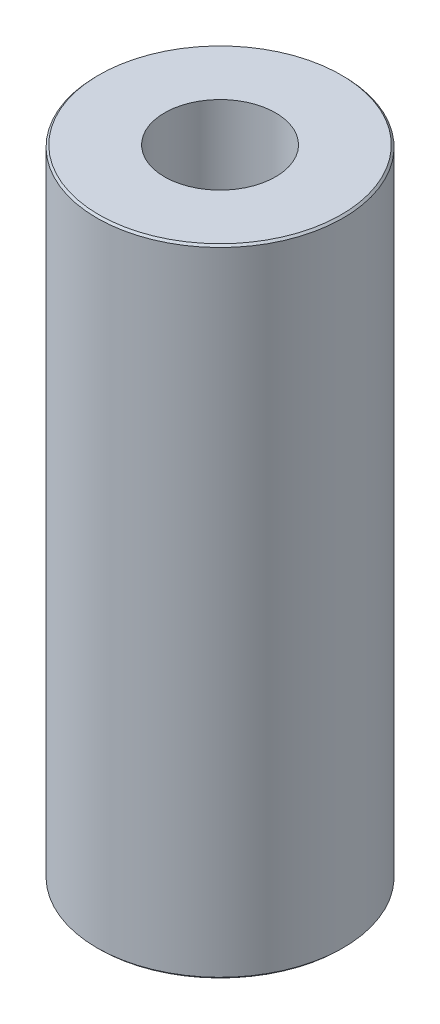
ISO-10303-21;
HEADER;
FILE_DESCRIPTION(('STEP AP214'),'2;1');
FILE_NAME('part.step','',(''),(''),'','','');
FILE_SCHEMA(('AUTOMOTIVE_DESIGN { 1 0 10303 214 1 1 1 1 }'));
ENDSEC;
DATA;
#1=APPLICATION_CONTEXT('core data for automotive mechanical design processes');
#2=APPLICATION_PROTOCOL_DEFINITION('international standard','automotive_design',2000,#1);
#3=PRODUCT_CONTEXT('',#1,'mechanical');
#4=PRODUCT('Part','Part','',(#3));
#5=PRODUCT_RELATED_PRODUCT_CATEGORY('part','',(#4));
#6=PRODUCT_DEFINITION_FORMATION('','',#4);
#7=PRODUCT_DEFINITION_CONTEXT('part definition',#1,'design');
#8=PRODUCT_DEFINITION('design','',#6,#7);
#9=PRODUCT_DEFINITION_SHAPE('','',#8);
#10=(LENGTH_UNIT() NAMED_UNIT(*) SI_UNIT(.MILLI.,.METRE.));
#11=(NAMED_UNIT(*) PLANE_ANGLE_UNIT() SI_UNIT($,.RADIAN.));
#12=(NAMED_UNIT(*) SI_UNIT($,.STERADIAN.) SOLID_ANGLE_UNIT());
#13=UNCERTAINTY_MEASURE_WITH_UNIT(LENGTH_MEASURE(1.E-05),#10,'distance_accuracy_value','');
#14=(GEOMETRIC_REPRESENTATION_CONTEXT(3) GLOBAL_UNCERTAINTY_ASSIGNED_CONTEXT((#13)) GLOBAL_UNIT_ASSIGNED_CONTEXT((#10,
#11,#12)) REPRESENTATION_CONTEXT('',''));
#15=CARTESIAN_POINT('',(0.,0.,0.));
#16=DIRECTION('',(0.,0.,1.));
#17=DIRECTION('',(1.,0.,0.));
#18=AXIS2_PLACEMENT_3D('',#15,#16,#17);
#19=CARTESIAN_POINT('',(0.,180.864894282994,0.));
#20=DIRECTION('',(0.,-1.,0.));
#21=DIRECTION('',(0.,0.,-1.));
#22=AXIS2_PLACEMENT_3D('',#19,#20,#21);
#23=CYLINDRICAL_SURFACE('',#22,35.);
#24=CARTESIAN_POINT('',(0.,180.317398691973,0.));
#25=DIRECTION('',(0.,1.,0.));
#26=DIRECTION('',(0.,0.,1.));
#27=AXIS2_PLACEMENT_3D('',#24,#25,#26);
#28=CIRCLE('',#27,35.);
#29=CARTESIAN_POINT('',(0.,180.317398691973,35.));
#30=VERTEX_POINT('',#29);
#31=EDGE_CURVE('E50',#30,#30,#28,.F.);
#32=ORIENTED_EDGE('',*,*,#31,.T.);
#33=EDGE_LOOP('',(#32));
#34=FACE_BOUND('',#33,.T.);
#35=CARTESIAN_POINT('',(0.,0.547495591021102,0.));
#36=DIRECTION('',(0.,1.,0.));
#37=DIRECTION('',(0.,0.,1.));
#38=AXIS2_PLACEMENT_3D('',#35,#36,#37);
#39=CIRCLE('',#38,35.);
#40=CARTESIAN_POINT('',(0.,0.547495591021102,35.));
#41=VERTEX_POINT('',#40);
#42=EDGE_CURVE('E51',#41,#41,#39,.T.);
#43=ORIENTED_EDGE('',*,*,#42,.T.);
#44=EDGE_LOOP('',(#43));
#45=FACE_BOUND('',#44,.T.);
#46=ADVANCED_FACE('F39',(#34,#45),#23,.T.);
#47=CARTESIAN_POINT('',(0.,180.864894282994,0.));
#48=DIRECTION('',(0.,1.,0.));
#49=DIRECTION('',(0.,0.,1.));
#50=AXIS2_PLACEMENT_3D('',#47,#48,#49);
#51=PLANE('',#50);
#52=CARTESIAN_POINT('',(0.,180.864894282994,0.));
#53=DIRECTION('',(0.,1.,0.));
#54=DIRECTION('',(0.,0.,1.));
#55=AXIS2_PLACEMENT_3D('',#52,#53,#54);
#56=CIRCLE('',#55,34.4525044089789);
#57=CARTESIAN_POINT('',(0.,180.864894282994,34.4525044089789));
#58=VERTEX_POINT('',#57);
#59=EDGE_CURVE('E54',#58,#58,#56,.T.);
#60=ORIENTED_EDGE('',*,*,#59,.T.);
#61=EDGE_LOOP('',(#60));
#62=FACE_BOUND('',#61,.T.);
#63=CARTESIAN_POINT('',(0.,180.864894282994,0.));
#64=DIRECTION('',(0.,1.,0.));
#65=DIRECTION('',(0.,0.,1.));
#66=AXIS2_PLACEMENT_3D('',#63,#64,#65);
#67=CIRCLE('',#66,15.7891906543089);
#68=CARTESIAN_POINT('',(0.,180.864894282994,15.7891906543089));
#69=VERTEX_POINT('',#68);
#70=EDGE_CURVE('E58',#69,#69,#67,.T.);
#71=ORIENTED_EDGE('',*,*,#70,.F.);
#72=EDGE_LOOP('',(#71));
#73=FACE_BOUND('',#72,.T.);
#74=ADVANCED_FACE('F69',(#62,#73),#51,.T.);
#75=CARTESIAN_POINT('',(0.,0.,0.));
#76=DIRECTION('',(0.,1.,0.));
#77=DIRECTION('',(0.,0.,1.));
#78=AXIS2_PLACEMENT_3D('',#75,#76,#77);
#79=PLANE('',#78);
#80=CARTESIAN_POINT('',(0.,0.,0.));
#81=DIRECTION('',(0.,1.,0.));
#82=DIRECTION('',(0.,0.,1.));
#83=AXIS2_PLACEMENT_3D('',#80,#81,#82);
#84=CIRCLE('',#83,34.4525044089789);
#85=CARTESIAN_POINT('',(0.,0.,34.4525044089789));
#86=VERTEX_POINT('',#85);
#87=EDGE_CURVE('E10',#86,#86,#84,.F.);
#88=ORIENTED_EDGE('',*,*,#87,.T.);
#89=EDGE_LOOP('',(#88));
#90=FACE_BOUND('',#89,.T.);
#91=CARTESIAN_POINT('',(0.,0.,0.));
#92=DIRECTION('',(0.,1.,0.));
#93=DIRECTION('',(0.,0.,1.));
#94=AXIS2_PLACEMENT_3D('',#91,#92,#93);
#95=CIRCLE('',#94,15.7891906543089);
#96=CARTESIAN_POINT('',(0.,0.,15.7891906543089));
#97=VERTEX_POINT('',#96);
#98=EDGE_CURVE('E63',#97,#97,#95,.T.);
#99=ORIENTED_EDGE('',*,*,#98,.T.);
#100=EDGE_LOOP('',(#99));
#101=FACE_BOUND('',#100,.T.);
#102=ADVANCED_FACE('F75',(#90,#101),#79,.F.);
#103=CARTESIAN_POINT('',(0.,180.864894282994,0.));
#104=DIRECTION('',(0.,-1.,0.));
#105=DIRECTION('',(0.,0.,-1.));
#106=AXIS2_PLACEMENT_3D('',#103,#104,#105);
#107=CYLINDRICAL_SURFACE('',#106,15.7891906543089);
#108=ORIENTED_EDGE('',*,*,#70,.T.);
#109=EDGE_LOOP('',(#108));
#110=FACE_BOUND('',#109,.T.);
#111=ORIENTED_EDGE('',*,*,#98,.F.);
#112=EDGE_LOOP('',(#111));
#113=FACE_BOUND('',#112,.T.);
#114=ADVANCED_FACE('F70',(#110,#113),#107,.F.);
#115=CARTESIAN_POINT('',(0.,180.864894282994,0.));
#116=DIRECTION('',(0.,-1.,0.));
#117=DIRECTION('',(0.,0.,-1.));
#118=AXIS2_PLACEMENT_3D('',#115,#116,#117);
#119=CONICAL_SURFACE('',#118,34.4525044089789,0.785398163397455);
#120=ORIENTED_EDGE('',*,*,#31,.F.);
#121=EDGE_LOOP('',(#120));
#122=FACE_BOUND('',#121,.T.);
#123=ORIENTED_EDGE('',*,*,#59,.F.);
#124=EDGE_LOOP('',(#123));
#125=FACE_BOUND('',#124,.T.);
#126=ADVANCED_FACE('F81',(#122,#125),#119,.T.);
#127=CARTESIAN_POINT('',(0.,0.547495591021102,0.));
#128=DIRECTION('',(0.,1.,0.));
#129=DIRECTION('',(0.,0.,1.));
#130=AXIS2_PLACEMENT_3D('',#127,#128,#129);
#131=CONICAL_SURFACE('',#130,35.,0.785398163397467);
#132=ORIENTED_EDGE('',*,*,#87,.F.);
#133=EDGE_LOOP('',(#132));
#134=FACE_BOUND('',#133,.T.);
#135=ORIENTED_EDGE('',*,*,#42,.F.);
#136=EDGE_LOOP('',(#135));
#137=FACE_BOUND('',#136,.T.);
#138=ADVANCED_FACE('F45',(#134,#137),#131,.T.);
#139=CLOSED_SHELL('',(#46,#74,#102,#114,#126,#138));
#140=MANIFOLD_SOLID_BREP('B2',#139);
#141=ADVANCED_BREP_SHAPE_REPRESENTATION('',(#18,#140),#14);
#142=SHAPE_DEFINITION_REPRESENTATION(#9,#141);
ENDSEC;
END-ISO-10303-21;
